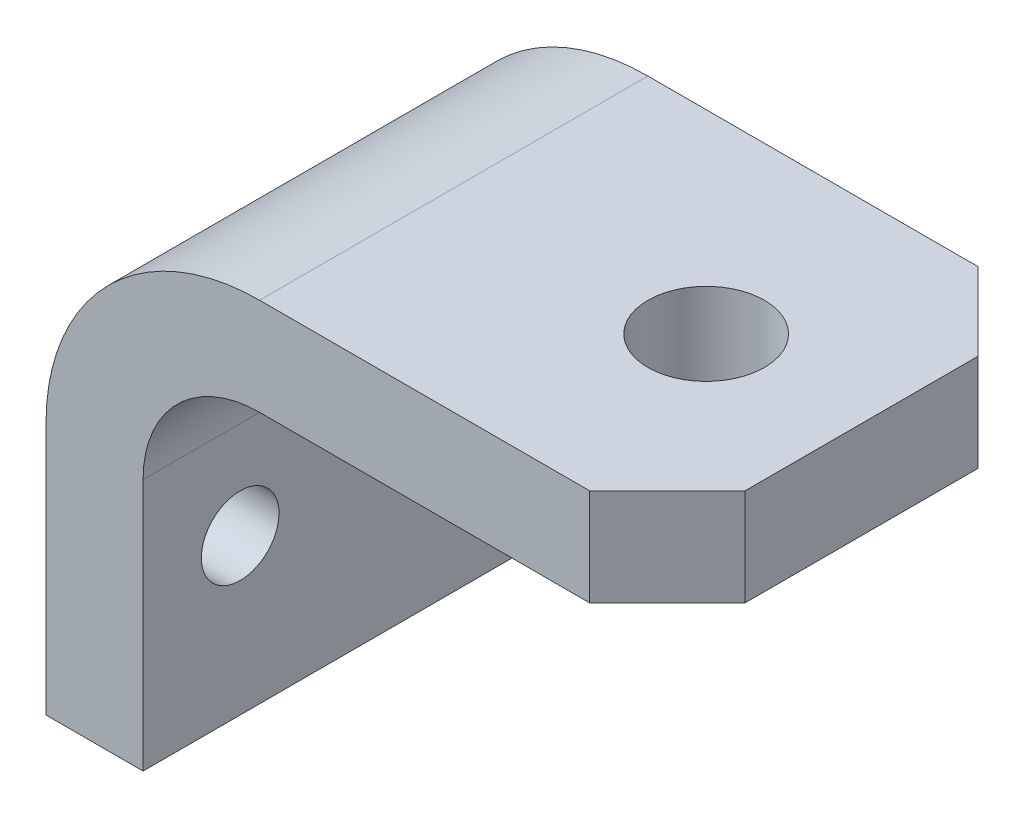
ISO-10303-21;
HEADER;
FILE_DESCRIPTION(('STEP AP214'),'2;1');
FILE_NAME('part.step','',(''),(''),'','','');
FILE_SCHEMA(('AUTOMOTIVE_DESIGN { 1 0 10303 214 1 1 1 1 }'));
ENDSEC;
DATA;
#1=APPLICATION_CONTEXT('core data for automotive mechanical design processes');
#2=APPLICATION_PROTOCOL_DEFINITION('international standard','automotive_design',2000,#1);
#3=PRODUCT_CONTEXT('',#1,'mechanical');
#4=PRODUCT('Part','Part','',(#3));
#5=PRODUCT_RELATED_PRODUCT_CATEGORY('part','',(#4));
#6=PRODUCT_DEFINITION_FORMATION('','',#4);
#7=PRODUCT_DEFINITION_CONTEXT('part definition',#1,'design');
#8=PRODUCT_DEFINITION('design','',#6,#7);
#9=PRODUCT_DEFINITION_SHAPE('','',#8);
#10=(LENGTH_UNIT() NAMED_UNIT(*) SI_UNIT(.MILLI.,.METRE.));
#11=(NAMED_UNIT(*) PLANE_ANGLE_UNIT() SI_UNIT($,.RADIAN.));
#12=(NAMED_UNIT(*) SI_UNIT($,.STERADIAN.) SOLID_ANGLE_UNIT());
#13=UNCERTAINTY_MEASURE_WITH_UNIT(LENGTH_MEASURE(1.E-05),#10,'distance_accuracy_value','');
#14=(GEOMETRIC_REPRESENTATION_CONTEXT(3) GLOBAL_UNCERTAINTY_ASSIGNED_CONTEXT((#13)) GLOBAL_UNIT_ASSIGNED_CONTEXT((#10,
#11,#12)) REPRESENTATION_CONTEXT('',''));
#15=CARTESIAN_POINT('',(0.,0.,0.));
#16=DIRECTION('',(0.,0.,1.));
#17=DIRECTION('',(1.,0.,0.));
#18=AXIS2_PLACEMENT_3D('',#15,#16,#17);
#19=CARTESIAN_POINT('',(25.4,0.,31.75));
#20=DIRECTION('',(-1.,0.,0.));
#21=DIRECTION('',(0.,-1.,0.));
#22=AXIS2_PLACEMENT_3D('',#19,#20,#21);
#23=PLANE('',#22);
#24=DIRECTION('',(0.,0.,-1.));
#25=VECTOR('',#24,1.);
#26=CARTESIAN_POINT('',(25.4,15.875,31.75));
#27=LINE('',#26,#25);
#28=CARTESIAN_POINT('',(25.4,15.875,19.0500000000001));
#29=VERTEX_POINT('',#28);
#30=CARTESIAN_POINT('',(25.4,15.875,-19.0500000000001));
#31=VERTEX_POINT('',#30);
#32=EDGE_CURVE('E120',#29,#31,#27,.T.);
#33=ORIENTED_EDGE('',*,*,#32,.F.);
#34=DIRECTION('',(0.,1.,0.));
#35=VECTOR('',#34,1.);
#36=CARTESIAN_POINT('',(25.4,-60.325,19.0500000000001));
#37=LINE('',#36,#35);
#38=CARTESIAN_POINT('',(25.4,0.,19.0500000000001));
#39=VERTEX_POINT('',#38);
#40=EDGE_CURVE('E108',#39,#29,#37,.T.);
#41=ORIENTED_EDGE('',*,*,#40,.F.);
#42=DIRECTION('',(0.,0.,-1.));
#43=VECTOR('',#42,1.);
#44=CARTESIAN_POINT('',(25.4,0.,31.75));
#45=LINE('',#44,#43);
#46=CARTESIAN_POINT('',(25.4,0.,-19.0500000000001));
#47=VERTEX_POINT('',#46);
#48=EDGE_CURVE('E164',#39,#47,#45,.T.);
#49=ORIENTED_EDGE('',*,*,#48,.T.);
#50=DIRECTION('',(0.,1.,0.));
#51=VECTOR('',#50,1.);
#52=CARTESIAN_POINT('',(25.4,-60.325,-19.0500000000001));
#53=LINE('',#52,#51);
#54=EDGE_CURVE('E127',#47,#31,#53,.T.);
#55=ORIENTED_EDGE('',*,*,#54,.T.);
#56=EDGE_LOOP('',(#33,#41,#49,#55));
#57=FACE_BOUND('',#56,.T.);
#58=ADVANCED_FACE('F34',(#57),#23,.F.);
#59=CARTESIAN_POINT('',(25.4,15.875,31.75));
#60=DIRECTION('',(0.,-1.,0.));
#61=DIRECTION('',(1.,0.,0.));
#62=AXIS2_PLACEMENT_3D('',#59,#60,#61);
#63=PLANE('',#62);
#64=CARTESIAN_POINT('',(0.,15.875,0.));
#65=DIRECTION('',(0.,1.,0.));
#66=DIRECTION('',(-1.,0.,0.));
#67=AXIS2_PLACEMENT_3D('',#64,#65,#66);
#68=CIRCLE('',#67,9.525);
#69=CARTESIAN_POINT('',(-9.525,15.875,0.));
#70=VERTEX_POINT('',#69);
#71=EDGE_CURVE('E138',#70,#70,#68,.T.);
#72=ORIENTED_EDGE('',*,*,#71,.F.);
#73=EDGE_LOOP('',(#72));
#74=FACE_BOUND('',#73,.T.);
#75=DIRECTION('',(-1.,0.,0.));
#76=VECTOR('',#75,1.);
#77=CARTESIAN_POINT('',(25.4,15.875,31.75));
#78=LINE('',#77,#76);
#79=CARTESIAN_POINT('',(12.7,15.875,31.75));
#80=VERTEX_POINT('',#79);
#81=CARTESIAN_POINT('',(-41.275,15.875,31.75));
#82=VERTEX_POINT('',#81);
#83=EDGE_CURVE('E123',#80,#82,#78,.T.);
#84=ORIENTED_EDGE('',*,*,#83,.F.);
#85=DIRECTION('',(-0.707106781186551,0.,0.707106781186544));
#86=VECTOR('',#85,1.);
#87=CARTESIAN_POINT('',(12.7,15.875,31.75));
#88=LINE('',#87,#86);
#89=EDGE_CURVE('E47',#29,#80,#88,.T.);
#90=ORIENTED_EDGE('',*,*,#89,.F.);
#91=ORIENTED_EDGE('',*,*,#32,.T.);
#92=DIRECTION('',(0.707106781186551,0.,0.707106781186544));
#93=VECTOR('',#92,1.);
#94=CARTESIAN_POINT('',(12.7,15.875,-31.75));
#95=LINE('',#94,#93);
#96=CARTESIAN_POINT('',(12.7,15.875,-31.75));
#97=VERTEX_POINT('',#96);
#98=EDGE_CURVE('E218',#97,#31,#95,.T.);
#99=ORIENTED_EDGE('',*,*,#98,.F.);
#100=DIRECTION('',(-1.,0.,0.));
#101=VECTOR('',#100,1.);
#102=CARTESIAN_POINT('',(25.4,15.875,-31.75));
#103=LINE('',#102,#101);
#104=CARTESIAN_POINT('',(-41.275,15.875,-31.75));
#105=VERTEX_POINT('',#104);
#106=EDGE_CURVE('E137',#97,#105,#103,.T.);
#107=ORIENTED_EDGE('',*,*,#106,.T.);
#108=DIRECTION('',(0.,0.,-1.));
#109=VECTOR('',#108,1.);
#110=CARTESIAN_POINT('',(-41.275,15.875,31.75));
#111=LINE('',#110,#109);
#112=EDGE_CURVE('E128',#82,#105,#111,.T.);
#113=ORIENTED_EDGE('',*,*,#112,.F.);
#114=EDGE_LOOP('',(#84,#90,#91,#99,#107,#113));
#115=FACE_BOUND('',#114,.T.);
#116=ADVANCED_FACE('F118',(#74,#115),#63,.F.);
#117=CARTESIAN_POINT('',(-41.275,-19.05,31.75));
#118=DIRECTION('',(0.,0.,-1.));
#119=DIRECTION('',(-1.,0.,0.));
#120=AXIS2_PLACEMENT_3D('',#117,#118,#119);
#121=CYLINDRICAL_SURFACE('',#120,34.925);
#122=CARTESIAN_POINT('',(-41.275,-19.05,-31.75));
#123=DIRECTION('',(0.,0.,1.));
#124=DIRECTION('',(1.,0.,0.));
#125=AXIS2_PLACEMENT_3D('',#122,#123,#124);
#126=CIRCLE('',#125,34.925);
#127=CARTESIAN_POINT('',(-76.2,-19.05,-31.75));
#128=VERTEX_POINT('',#127);
#129=EDGE_CURVE('E141',#105,#128,#126,.T.);
#130=ORIENTED_EDGE('',*,*,#129,.T.);
#131=DIRECTION('',(0.,0.,-1.));
#132=VECTOR('',#131,1.);
#133=CARTESIAN_POINT('',(-76.2,-19.05,31.75));
#134=LINE('',#133,#132);
#135=CARTESIAN_POINT('',(-76.2,-19.05,31.75));
#136=VERTEX_POINT('',#135);
#137=EDGE_CURVE('E131',#136,#128,#134,.T.);
#138=ORIENTED_EDGE('',*,*,#137,.F.);
#139=CARTESIAN_POINT('',(-41.275,-19.05,31.75));
#140=DIRECTION('',(0.,0.,1.));
#141=DIRECTION('',(1.,0.,0.));
#142=AXIS2_PLACEMENT_3D('',#139,#140,#141);
#143=CIRCLE('',#142,34.925);
#144=EDGE_CURVE('E151',#82,#136,#143,.T.);
#145=ORIENTED_EDGE('',*,*,#144,.F.);
#146=ORIENTED_EDGE('',*,*,#112,.T.);
#147=EDGE_LOOP('',(#130,#138,#145,#146));
#148=FACE_BOUND('',#147,.T.);
#149=ADVANCED_FACE('F217',(#148),#121,.T.);
#150=CARTESIAN_POINT('',(-76.2,-60.325,31.75));
#151=DIRECTION('',(1.,0.,0.));
#152=DIRECTION('',(0.,0.,-1.));
#153=AXIS2_PLACEMENT_3D('',#150,#151,#152);
#154=PLANE('',#153);
#155=CARTESIAN_POINT('',(-76.2,-34.925,-15.875));
#156=DIRECTION('',(1.,0.,0.));
#157=DIRECTION('',(0.,0.,-1.));
#158=AXIS2_PLACEMENT_3D('',#155,#156,#157);
#159=CIRCLE('',#158,6.35);
#160=CARTESIAN_POINT('',(-76.2,-34.925,-22.225));
#161=VERTEX_POINT('',#160);
#162=EDGE_CURVE('E359',#161,#161,#159,.F.);
#163=ORIENTED_EDGE('',*,*,#162,.F.);
#164=EDGE_LOOP('',(#163));
#165=FACE_BOUND('',#164,.T.);
#166=CARTESIAN_POINT('',(-76.2,-34.925,15.875));
#167=DIRECTION('',(1.,0.,0.));
#168=DIRECTION('',(0.,0.,-1.));
#169=AXIS2_PLACEMENT_3D('',#166,#167,#168);
#170=CIRCLE('',#169,6.35);
#171=CARTESIAN_POINT('',(-76.2,-34.925,9.525));
#172=VERTEX_POINT('',#171);
#173=EDGE_CURVE('E124',#172,#172,#170,.F.);
#174=ORIENTED_EDGE('',*,*,#173,.F.);
#175=EDGE_LOOP('',(#174));
#176=FACE_BOUND('',#175,.T.);
#177=DIRECTION('',(0.,-1.,0.));
#178=VECTOR('',#177,1.);
#179=CARTESIAN_POINT('',(-76.2,-60.325,-31.75));
#180=LINE('',#179,#178);
#181=CARTESIAN_POINT('',(-76.2,-60.325,-31.75));
#182=VERTEX_POINT('',#181);
#183=EDGE_CURVE('E167',#128,#182,#180,.T.);
#184=ORIENTED_EDGE('',*,*,#183,.T.);
#185=DIRECTION('',(0.,0.,-1.));
#186=VECTOR('',#185,1.);
#187=CARTESIAN_POINT('',(-76.2,-60.325,31.75));
#188=LINE('',#187,#186);
#189=CARTESIAN_POINT('',(-76.2,-60.325,31.75));
#190=VERTEX_POINT('',#189);
#191=EDGE_CURVE('E187',#190,#182,#188,.T.);
#192=ORIENTED_EDGE('',*,*,#191,.F.);
#193=DIRECTION('',(0.,-1.,0.));
#194=VECTOR('',#193,1.);
#195=CARTESIAN_POINT('',(-76.2,-60.325,31.75));
#196=LINE('',#195,#194);
#197=EDGE_CURVE('E154',#136,#190,#196,.T.);
#198=ORIENTED_EDGE('',*,*,#197,.F.);
#199=ORIENTED_EDGE('',*,*,#137,.T.);
#200=EDGE_LOOP('',(#184,#192,#198,#199));
#201=FACE_BOUND('',#200,.T.);
#202=ADVANCED_FACE('F194',(#165,#176,#201),#154,.F.);
#203=CARTESIAN_POINT('',(-76.2,-60.325,31.75));
#204=DIRECTION('',(0.,1.,0.));
#205=DIRECTION('',(0.,0.,1.));
#206=AXIS2_PLACEMENT_3D('',#203,#204,#205);
#207=PLANE('',#206);
#208=DIRECTION('',(1.,0.,0.));
#209=VECTOR('',#208,1.);
#210=CARTESIAN_POINT('',(-76.2,-60.325,-31.75));
#211=LINE('',#210,#209);
#212=CARTESIAN_POINT('',(-60.325,-60.325,-31.75));
#213=VERTEX_POINT('',#212);
#214=EDGE_CURVE('E169',#182,#213,#211,.T.);
#215=ORIENTED_EDGE('',*,*,#214,.T.);
#216=DIRECTION('',(0.,0.,-1.));
#217=VECTOR('',#216,1.);
#218=CARTESIAN_POINT('',(-60.325,-60.325,31.75));
#219=LINE('',#218,#217);
#220=CARTESIAN_POINT('',(-60.325,-60.325,31.75));
#221=VERTEX_POINT('',#220);
#222=EDGE_CURVE('E184',#221,#213,#219,.T.);
#223=ORIENTED_EDGE('',*,*,#222,.F.);
#224=DIRECTION('',(1.,0.,0.));
#225=VECTOR('',#224,1.);
#226=CARTESIAN_POINT('',(-76.2,-60.325,31.75));
#227=LINE('',#226,#225);
#228=EDGE_CURVE('E156',#190,#221,#227,.T.);
#229=ORIENTED_EDGE('',*,*,#228,.F.);
#230=ORIENTED_EDGE('',*,*,#191,.T.);
#231=EDGE_LOOP('',(#215,#223,#229,#230));
#232=FACE_BOUND('',#231,.T.);
#233=ADVANCED_FACE('F207',(#232),#207,.F.);
#234=CARTESIAN_POINT('',(-60.325,-60.325,31.75));
#235=DIRECTION('',(-1.,0.,0.));
#236=DIRECTION('',(0.,-1.,0.));
#237=AXIS2_PLACEMENT_3D('',#234,#235,#236);
#238=PLANE('',#237);
#239=CARTESIAN_POINT('',(-60.325,-34.925,-15.875));
#240=DIRECTION('',(1.,0.,0.));
#241=DIRECTION('',(0.,1.,0.));
#242=AXIS2_PLACEMENT_3D('',#239,#240,#241);
#243=CIRCLE('',#242,6.35);
#244=CARTESIAN_POINT('',(-60.325,-28.575,-15.875));
#245=VERTEX_POINT('',#244);
#246=EDGE_CURVE('E356',#245,#245,#243,.T.);
#247=ORIENTED_EDGE('',*,*,#246,.F.);
#248=EDGE_LOOP('',(#247));
#249=FACE_BOUND('',#248,.T.);
#250=CARTESIAN_POINT('',(-60.325,-34.925,15.875));
#251=DIRECTION('',(1.,0.,0.));
#252=DIRECTION('',(0.,1.,0.));
#253=AXIS2_PLACEMENT_3D('',#250,#251,#252);
#254=CIRCLE('',#253,6.35);
#255=CARTESIAN_POINT('',(-60.325,-28.575,15.875));
#256=VERTEX_POINT('',#255);
#257=EDGE_CURVE('E360',#256,#256,#254,.T.);
#258=ORIENTED_EDGE('',*,*,#257,.F.);
#259=EDGE_LOOP('',(#258));
#260=FACE_BOUND('',#259,.T.);
#261=DIRECTION('',(0.,1.,0.));
#262=VECTOR('',#261,1.);
#263=CARTESIAN_POINT('',(-60.325,-60.325,-31.75));
#264=LINE('',#263,#262);
#265=CARTESIAN_POINT('',(-60.325,-19.05,-31.75));
#266=VERTEX_POINT('',#265);
#267=EDGE_CURVE('E171',#213,#266,#264,.T.);
#268=ORIENTED_EDGE('',*,*,#267,.T.);
#269=DIRECTION('',(0.,0.,-1.));
#270=VECTOR('',#269,1.);
#271=CARTESIAN_POINT('',(-60.325,-19.05,31.75));
#272=LINE('',#271,#270);
#273=CARTESIAN_POINT('',(-60.325,-19.05,31.75));
#274=VERTEX_POINT('',#273);
#275=EDGE_CURVE('E181',#274,#266,#272,.T.);
#276=ORIENTED_EDGE('',*,*,#275,.F.);
#277=DIRECTION('',(0.,1.,0.));
#278=VECTOR('',#277,1.);
#279=CARTESIAN_POINT('',(-60.325,-60.325,31.75));
#280=LINE('',#279,#278);
#281=EDGE_CURVE('E158',#221,#274,#280,.T.);
#282=ORIENTED_EDGE('',*,*,#281,.F.);
#283=ORIENTED_EDGE('',*,*,#222,.T.);
#284=EDGE_LOOP('',(#268,#276,#282,#283));
#285=FACE_BOUND('',#284,.T.);
#286=ADVANCED_FACE('F211',(#249,#260,#285),#238,.F.);
#287=CARTESIAN_POINT('',(-41.275,-19.05,31.75));
#288=DIRECTION('',(0.,0.,-1.));
#289=DIRECTION('',(-1.,0.,0.));
#290=AXIS2_PLACEMENT_3D('',#287,#288,#289);
#291=CYLINDRICAL_SURFACE('',#290,19.05);
#292=CARTESIAN_POINT('',(-41.275,-19.05,-31.75));
#293=DIRECTION('',(0.,0.,-1.));
#294=DIRECTION('',(1.,0.,0.));
#295=AXIS2_PLACEMENT_3D('',#292,#293,#294);
#296=CIRCLE('',#295,19.05);
#297=CARTESIAN_POINT('',(-41.275,0.,-31.75));
#298=VERTEX_POINT('',#297);
#299=EDGE_CURVE('E173',#266,#298,#296,.T.);
#300=ORIENTED_EDGE('',*,*,#299,.T.);
#301=DIRECTION('',(0.,0.,-1.));
#302=VECTOR('',#301,1.);
#303=CARTESIAN_POINT('',(-41.275,0.,31.75));
#304=LINE('',#303,#302);
#305=CARTESIAN_POINT('',(-41.275,0.,31.75));
#306=VERTEX_POINT('',#305);
#307=EDGE_CURVE('E178',#306,#298,#304,.T.);
#308=ORIENTED_EDGE('',*,*,#307,.F.);
#309=CARTESIAN_POINT('',(-41.275,-19.05,31.75));
#310=DIRECTION('',(0.,0.,-1.));
#311=DIRECTION('',(1.,0.,0.));
#312=AXIS2_PLACEMENT_3D('',#309,#310,#311);
#313=CIRCLE('',#312,19.05);
#314=EDGE_CURVE('E160',#274,#306,#313,.T.);
#315=ORIENTED_EDGE('',*,*,#314,.F.);
#316=ORIENTED_EDGE('',*,*,#275,.T.);
#317=EDGE_LOOP('',(#300,#308,#315,#316));
#318=FACE_BOUND('',#317,.T.);
#319=ADVANCED_FACE('F224',(#318),#291,.F.);
#320=CARTESIAN_POINT('',(25.4,0.,31.75));
#321=DIRECTION('',(0.,1.,0.));
#322=DIRECTION('',(-1.,0.,0.));
#323=AXIS2_PLACEMENT_3D('',#320,#321,#322);
#324=PLANE('',#323);
#325=CARTESIAN_POINT('',(0.,0.,0.));
#326=DIRECTION('',(0.,1.,0.));
#327=DIRECTION('',(-1.,0.,0.));
#328=AXIS2_PLACEMENT_3D('',#325,#326,#327);
#329=CIRCLE('',#328,9.525);
#330=CARTESIAN_POINT('',(-9.525,0.,0.));
#331=VERTEX_POINT('',#330);
#332=EDGE_CURVE('E135',#331,#331,#329,.T.);
#333=ORIENTED_EDGE('',*,*,#332,.T.);
#334=EDGE_LOOP('',(#333));
#335=FACE_BOUND('',#334,.T.);
#336=ORIENTED_EDGE('',*,*,#48,.F.);
#337=DIRECTION('',(-0.707106781186551,0.,0.707106781186544));
#338=VECTOR('',#337,1.);
#339=CARTESIAN_POINT('',(19.0500000000001,0.,25.4));
#340=LINE('',#339,#338);
#341=CARTESIAN_POINT('',(12.7,0.,31.75));
#342=VERTEX_POINT('',#341);
#343=EDGE_CURVE('E111',#39,#342,#340,.T.);
#344=ORIENTED_EDGE('',*,*,#343,.T.);
#345=DIRECTION('',(1.,0.,0.));
#346=VECTOR('',#345,1.);
#347=CARTESIAN_POINT('',(25.4,0.,31.75));
#348=LINE('',#347,#346);
#349=EDGE_CURVE('E162',#306,#342,#348,.T.);
#350=ORIENTED_EDGE('',*,*,#349,.F.);
#351=ORIENTED_EDGE('',*,*,#307,.T.);
#352=DIRECTION('',(1.,0.,0.));
#353=VECTOR('',#352,1.);
#354=CARTESIAN_POINT('',(25.4,0.,-31.75));
#355=LINE('',#354,#353);
#356=CARTESIAN_POINT('',(12.7,0.,-31.75));
#357=VERTEX_POINT('',#356);
#358=EDGE_CURVE('E152',#298,#357,#355,.T.);
#359=ORIENTED_EDGE('',*,*,#358,.T.);
#360=DIRECTION('',(0.707106781186551,0.,0.707106781186544));
#361=VECTOR('',#360,1.);
#362=CARTESIAN_POINT('',(50.8000000000001,0.,6.34999999999966));
#363=LINE('',#362,#361);
#364=EDGE_CURVE('E55',#357,#47,#363,.T.);
#365=ORIENTED_EDGE('',*,*,#364,.T.);
#366=EDGE_LOOP('',(#336,#344,#350,#351,#359,#365));
#367=FACE_BOUND('',#366,.T.);
#368=ADVANCED_FACE('F221',(#335,#367),#324,.F.);
#369=CARTESIAN_POINT('',(-41.275,-19.05,31.75));
#370=DIRECTION('',(0.,0.,1.));
#371=DIRECTION('',(1.,0.,0.));
#372=AXIS2_PLACEMENT_3D('',#369,#370,#371);
#373=PLANE('',#372);
#374=DIRECTION('',(0.,-1.,0.));
#375=VECTOR('',#374,1.);
#376=CARTESIAN_POINT('',(12.7,-19.05,31.75));
#377=LINE('',#376,#375);
#378=EDGE_CURVE('E11',#80,#342,#377,.T.);
#379=ORIENTED_EDGE('',*,*,#378,.F.);
#380=ORIENTED_EDGE('',*,*,#83,.T.);
#381=ORIENTED_EDGE('',*,*,#144,.T.);
#382=ORIENTED_EDGE('',*,*,#197,.T.);
#383=ORIENTED_EDGE('',*,*,#228,.T.);
#384=ORIENTED_EDGE('',*,*,#281,.T.);
#385=ORIENTED_EDGE('',*,*,#314,.T.);
#386=ORIENTED_EDGE('',*,*,#349,.T.);
#387=EDGE_LOOP('',(#379,#380,#381,#382,#383,#384,#385,#386));
#388=FACE_BOUND('',#387,.T.);
#389=ADVANCED_FACE('F215',(#388),#373,.T.);
#390=CARTESIAN_POINT('',(-41.275,-19.05,-31.75));
#391=DIRECTION('',(0.,0.,1.));
#392=DIRECTION('',(1.,0.,0.));
#393=AXIS2_PLACEMENT_3D('',#390,#391,#392);
#394=PLANE('',#393);
#395=ORIENTED_EDGE('',*,*,#106,.F.);
#396=DIRECTION('',(0.,-1.,0.));
#397=VECTOR('',#396,1.);
#398=CARTESIAN_POINT('',(12.7,-19.05,-31.75));
#399=LINE('',#398,#397);
#400=EDGE_CURVE('E41',#97,#357,#399,.T.);
#401=ORIENTED_EDGE('',*,*,#400,.T.);
#402=ORIENTED_EDGE('',*,*,#358,.F.);
#403=ORIENTED_EDGE('',*,*,#299,.F.);
#404=ORIENTED_EDGE('',*,*,#267,.F.);
#405=ORIENTED_EDGE('',*,*,#214,.F.);
#406=ORIENTED_EDGE('',*,*,#183,.F.);
#407=ORIENTED_EDGE('',*,*,#129,.F.);
#408=EDGE_LOOP('',(#395,#401,#402,#403,#404,#405,#406,#407));
#409=FACE_BOUND('',#408,.T.);
#410=ADVANCED_FACE('F202',(#409),#394,.F.);
#411=CARTESIAN_POINT('',(0.,-60.325,0.));
#412=DIRECTION('',(0.,1.,0.));
#413=DIRECTION('',(-1.,0.,0.));
#414=AXIS2_PLACEMENT_3D('',#411,#412,#413);
#415=CYLINDRICAL_SURFACE('',#414,9.525);
#416=ORIENTED_EDGE('',*,*,#71,.T.);
#417=EDGE_LOOP('',(#416));
#418=FACE_BOUND('',#417,.T.);
#419=ORIENTED_EDGE('',*,*,#332,.F.);
#420=EDGE_LOOP('',(#419));
#421=FACE_BOUND('',#420,.T.);
#422=ADVANCED_FACE('F294',(#418,#421),#415,.F.);
#423=CARTESIAN_POINT('',(12.7,-60.325,-31.75));
#424=DIRECTION('',(-0.707106781186544,0.,0.707106781186551));
#425=DIRECTION('',(0.707106781186551,0.,0.707106781186544));
#426=AXIS2_PLACEMENT_3D('',#423,#424,#425);
#427=PLANE('',#426);
#428=ORIENTED_EDGE('',*,*,#400,.F.);
#429=ORIENTED_EDGE('',*,*,#98,.T.);
#430=ORIENTED_EDGE('',*,*,#54,.F.);
#431=ORIENTED_EDGE('',*,*,#364,.F.);
#432=EDGE_LOOP('',(#428,#429,#430,#431));
#433=FACE_BOUND('',#432,.T.);
#434=ADVANCED_FACE('F291',(#433),#427,.F.);
#435=CARTESIAN_POINT('',(12.7,-60.325,31.75));
#436=DIRECTION('',(-0.707106781186544,0.,-0.707106781186551));
#437=DIRECTION('',(-0.707106781186551,0.,0.707106781186544));
#438=AXIS2_PLACEMENT_3D('',#435,#436,#437);
#439=PLANE('',#438);
#440=ORIENTED_EDGE('',*,*,#40,.T.);
#441=ORIENTED_EDGE('',*,*,#89,.T.);
#442=ORIENTED_EDGE('',*,*,#378,.T.);
#443=ORIENTED_EDGE('',*,*,#343,.F.);
#444=EDGE_LOOP('',(#440,#441,#442,#443));
#445=FACE_BOUND('',#444,.T.);
#446=ADVANCED_FACE('F109',(#445),#439,.F.);
#447=CARTESIAN_POINT('',(-76.201,-34.925,15.875));
#448=DIRECTION('',(1.,0.,0.));
#449=DIRECTION('',(0.,1.,0.));
#450=AXIS2_PLACEMENT_3D('',#447,#448,#449);
#451=CYLINDRICAL_SURFACE('',#450,6.35);
#452=ORIENTED_EDGE('',*,*,#257,.T.);
#453=EDGE_LOOP('',(#452));
#454=FACE_BOUND('',#453,.T.);
#455=ORIENTED_EDGE('',*,*,#173,.T.);
#456=EDGE_LOOP('',(#455));
#457=FACE_BOUND('',#456,.T.);
#458=ADVANCED_FACE('F266',(#454,#457),#451,.F.);
#459=CARTESIAN_POINT('',(-76.201,-34.925,-15.875));
#460=DIRECTION('',(1.,0.,0.));
#461=DIRECTION('',(0.,1.,0.));
#462=AXIS2_PLACEMENT_3D('',#459,#460,#461);
#463=CYLINDRICAL_SURFACE('',#462,6.35);
#464=ORIENTED_EDGE('',*,*,#246,.T.);
#465=EDGE_LOOP('',(#464));
#466=FACE_BOUND('',#465,.T.);
#467=ORIENTED_EDGE('',*,*,#162,.T.);
#468=EDGE_LOOP('',(#467));
#469=FACE_BOUND('',#468,.T.);
#470=ADVANCED_FACE('F271',(#466,#469),#463,.F.);
#471=CLOSED_SHELL('',(#58,#116,#149,#202,#233,#286,#319,#368,#389,#410,#422,#434,#446,#458,#470));
#472=MANIFOLD_SOLID_BREP('B2',#471);
#473=ADVANCED_BREP_SHAPE_REPRESENTATION('',(#18,#472),#14);
#474=SHAPE_DEFINITION_REPRESENTATION(#9,#473);
ENDSEC;
END-ISO-10303-21;
